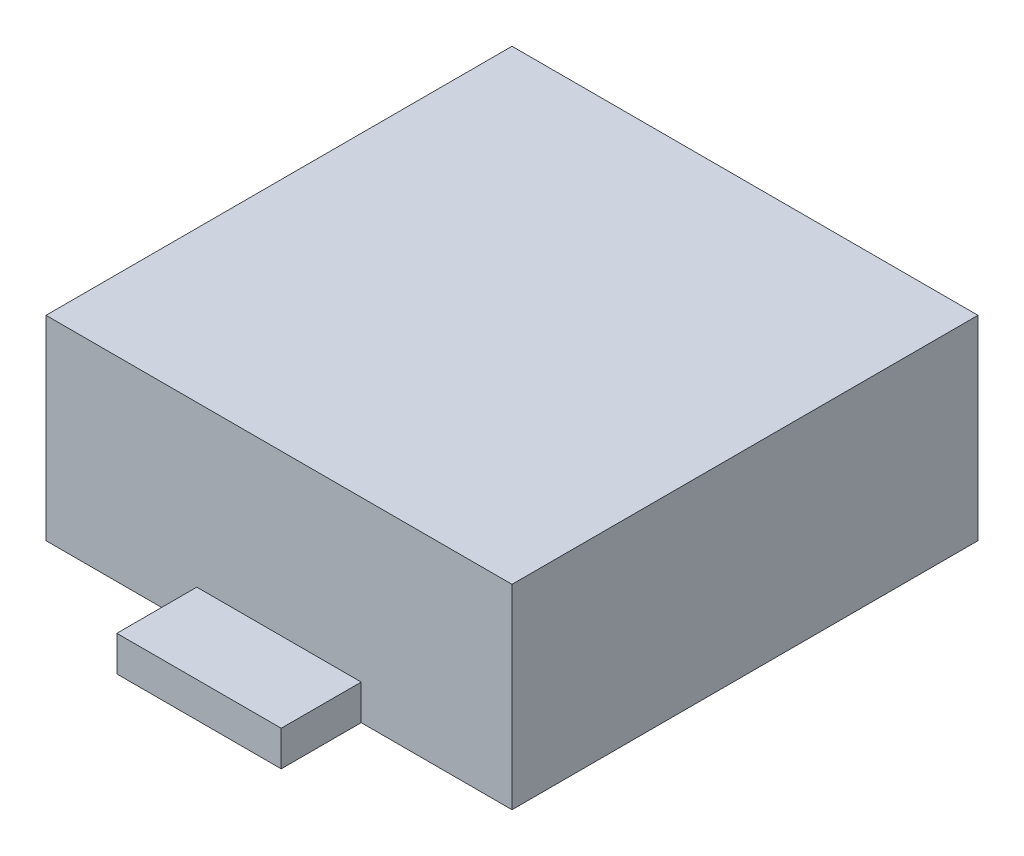
ISO-10303-21;
HEADER;
FILE_DESCRIPTION(('STEP AP214'),'2;1');
FILE_NAME('part.step','',(''),(''),'','','');
FILE_SCHEMA(('AUTOMOTIVE_DESIGN { 1 0 10303 214 1 1 1 1 }'));
ENDSEC;
DATA;
#1=APPLICATION_CONTEXT('core data for automotive mechanical design processes');
#2=APPLICATION_PROTOCOL_DEFINITION('international standard','automotive_design',2000,#1);
#3=PRODUCT_CONTEXT('',#1,'mechanical');
#4=PRODUCT('Part','Part','',(#3));
#5=PRODUCT_RELATED_PRODUCT_CATEGORY('part','',(#4));
#6=PRODUCT_DEFINITION_FORMATION('','',#4);
#7=PRODUCT_DEFINITION_CONTEXT('part definition',#1,'design');
#8=PRODUCT_DEFINITION('design','',#6,#7);
#9=PRODUCT_DEFINITION_SHAPE('','',#8);
#10=(LENGTH_UNIT() NAMED_UNIT(*) SI_UNIT(.MILLI.,.METRE.));
#11=(NAMED_UNIT(*) PLANE_ANGLE_UNIT() SI_UNIT($,.RADIAN.));
#12=(NAMED_UNIT(*) SI_UNIT($,.STERADIAN.) SOLID_ANGLE_UNIT());
#13=UNCERTAINTY_MEASURE_WITH_UNIT(LENGTH_MEASURE(1.E-05),#10,'distance_accuracy_value','');
#14=(GEOMETRIC_REPRESENTATION_CONTEXT(3) GLOBAL_UNCERTAINTY_ASSIGNED_CONTEXT((#13)) GLOBAL_UNIT_ASSIGNED_CONTEXT((#10,
#11,#12)) REPRESENTATION_CONTEXT('',''));
#15=CARTESIAN_POINT('',(0.,0.,0.));
#16=DIRECTION('',(0.,0.,1.));
#17=DIRECTION('',(1.,0.,0.));
#18=AXIS2_PLACEMENT_3D('',#15,#16,#17);
#19=CARTESIAN_POINT('',(0.,31.,0.));
#20=DIRECTION('',(0.,0.,-1.));
#21=DIRECTION('',(-1.,0.,0.));
#22=AXIS2_PLACEMENT_3D('',#19,#20,#21);
#23=PLANE('',#22);
#24=DIRECTION('',(0.,-1.,0.));
#25=VECTOR('',#24,1.);
#26=CARTESIAN_POINT('',(23.9467048567121,5.58863707499313,0.));
#27=LINE('',#26,#25);
#28=CARTESIAN_POINT('',(23.9467048567121,5.58863707499313,0.));
#29=VERTEX_POINT('',#28);
#30=CARTESIAN_POINT('',(23.9467048567121,0.,0.));
#31=VERTEX_POINT('',#30);
#32=EDGE_CURVE('E51',#29,#31,#27,.T.);
#33=ORIENTED_EDGE('',*,*,#32,.F.);
#34=DIRECTION('',(-1.,0.,0.));
#35=VECTOR('',#34,1.);
#36=CARTESIAN_POINT('',(23.9467048567121,5.58863707499313,0.));
#37=LINE('',#36,#35);
#38=CARTESIAN_POINT('',(50.0532951432879,5.58863707499314,0.));
#39=VERTEX_POINT('',#38);
#40=EDGE_CURVE('E120',#39,#29,#37,.T.);
#41=ORIENTED_EDGE('',*,*,#40,.F.);
#42=DIRECTION('',(0.,1.,0.));
#43=VECTOR('',#42,1.);
#44=CARTESIAN_POINT('',(50.0532951432879,5.58863707499314,0.));
#45=LINE('',#44,#43);
#46=CARTESIAN_POINT('',(50.0532951432879,0.,0.));
#47=VERTEX_POINT('',#46);
#48=EDGE_CURVE('E57',#47,#39,#45,.T.);
#49=ORIENTED_EDGE('',*,*,#48,.F.);
#50=DIRECTION('',(1.,0.,0.));
#51=VECTOR('',#50,1.);
#52=CARTESIAN_POINT('',(0.,0.,0.));
#53=LINE('',#52,#51);
#54=CARTESIAN_POINT('',(74.,0.,0.));
#55=VERTEX_POINT('',#54);
#56=EDGE_CURVE('E126',#47,#55,#53,.T.);
#57=ORIENTED_EDGE('',*,*,#56,.T.);
#58=DIRECTION('',(0.,-1.,0.));
#59=VECTOR('',#58,1.);
#60=CARTESIAN_POINT('',(74.,31.,0.));
#61=LINE('',#60,#59);
#62=CARTESIAN_POINT('',(74.,31.,0.));
#63=VERTEX_POINT('',#62);
#64=EDGE_CURVE('E44',#63,#55,#61,.T.);
#65=ORIENTED_EDGE('',*,*,#64,.F.);
#66=DIRECTION('',(1.,0.,0.));
#67=VECTOR('',#66,1.);
#68=CARTESIAN_POINT('',(0.,31.,0.));
#69=LINE('',#68,#67);
#70=CARTESIAN_POINT('',(0.,31.,0.));
#71=VERTEX_POINT('',#70);
#72=EDGE_CURVE('E135',#71,#63,#69,.T.);
#73=ORIENTED_EDGE('',*,*,#72,.F.);
#74=DIRECTION('',(0.,-1.,0.));
#75=VECTOR('',#74,1.);
#76=CARTESIAN_POINT('',(0.,31.,0.));
#77=LINE('',#76,#75);
#78=CARTESIAN_POINT('',(0.,0.,0.));
#79=VERTEX_POINT('',#78);
#80=EDGE_CURVE('E11',#71,#79,#77,.T.);
#81=ORIENTED_EDGE('',*,*,#80,.T.);
#82=EDGE_CURVE('E143',#79,#31,#53,.T.);
#83=ORIENTED_EDGE('',*,*,#82,.T.);
#84=EDGE_LOOP('',(#33,#41,#49,#57,#65,#73,#81,#83));
#85=FACE_BOUND('',#84,.T.);
#86=ADVANCED_FACE('F36',(#85),#23,.F.);
#87=CARTESIAN_POINT('',(0.,31.,0.));
#88=DIRECTION('',(1.,0.,0.));
#89=DIRECTION('',(0.,0.,-1.));
#90=AXIS2_PLACEMENT_3D('',#87,#88,#89);
#91=PLANE('',#90);
#92=DIRECTION('',(0.,0.,1.));
#93=VECTOR('',#92,1.);
#94=CARTESIAN_POINT('',(0.,0.,0.));
#95=LINE('',#94,#93);
#96=CARTESIAN_POINT('',(0.,0.,-74.));
#97=VERTEX_POINT('',#96);
#98=EDGE_CURVE('E123',#97,#79,#95,.T.);
#99=ORIENTED_EDGE('',*,*,#98,.T.);
#100=ORIENTED_EDGE('',*,*,#80,.F.);
#101=DIRECTION('',(0.,0.,1.));
#102=VECTOR('',#101,1.);
#103=CARTESIAN_POINT('',(0.,31.,0.));
#104=LINE('',#103,#102);
#105=CARTESIAN_POINT('',(0.,31.,-74.));
#106=VERTEX_POINT('',#105);
#107=EDGE_CURVE('E132',#106,#71,#104,.T.);
#108=ORIENTED_EDGE('',*,*,#107,.F.);
#109=DIRECTION('',(0.,-1.,0.));
#110=VECTOR('',#109,1.);
#111=CARTESIAN_POINT('',(0.,31.,-74.));
#112=LINE('',#111,#110);
#113=EDGE_CURVE('E141',#106,#97,#112,.T.);
#114=ORIENTED_EDGE('',*,*,#113,.T.);
#115=EDGE_LOOP('',(#99,#100,#108,#114));
#116=FACE_BOUND('',#115,.T.);
#117=ADVANCED_FACE('F38',(#116),#91,.F.);
#118=CARTESIAN_POINT('',(74.,31.,0.));
#119=DIRECTION('',(-1.,0.,0.));
#120=DIRECTION('',(0.,0.,1.));
#121=AXIS2_PLACEMENT_3D('',#118,#119,#120);
#122=PLANE('',#121);
#123=DIRECTION('',(0.,0.,-1.));
#124=VECTOR('',#123,1.);
#125=CARTESIAN_POINT('',(74.,0.,0.));
#126=LINE('',#125,#124);
#127=CARTESIAN_POINT('',(74.,0.,-74.));
#128=VERTEX_POINT('',#127);
#129=EDGE_CURVE('E145',#55,#128,#126,.T.);
#130=ORIENTED_EDGE('',*,*,#129,.T.);
#131=DIRECTION('',(0.,-1.,0.));
#132=VECTOR('',#131,1.);
#133=CARTESIAN_POINT('',(74.,31.,-74.));
#134=LINE('',#133,#132);
#135=CARTESIAN_POINT('',(74.,31.,-74.));
#136=VERTEX_POINT('',#135);
#137=EDGE_CURVE('E150',#136,#128,#134,.T.);
#138=ORIENTED_EDGE('',*,*,#137,.F.);
#139=DIRECTION('',(0.,0.,-1.));
#140=VECTOR('',#139,1.);
#141=CARTESIAN_POINT('',(74.,31.,0.));
#142=LINE('',#141,#140);
#143=EDGE_CURVE('E138',#63,#136,#142,.T.);
#144=ORIENTED_EDGE('',*,*,#143,.F.);
#145=ORIENTED_EDGE('',*,*,#64,.T.);
#146=EDGE_LOOP('',(#130,#138,#144,#145));
#147=FACE_BOUND('',#146,.T.);
#148=ADVANCED_FACE('F157',(#147),#122,.F.);
#149=CARTESIAN_POINT('',(0.,31.,-74.));
#150=DIRECTION('',(0.,0.,1.));
#151=DIRECTION('',(1.,0.,0.));
#152=AXIS2_PLACEMENT_3D('',#149,#150,#151);
#153=PLANE('',#152);
#154=DIRECTION('',(-1.,0.,0.));
#155=VECTOR('',#154,1.);
#156=CARTESIAN_POINT('',(0.,0.,-74.));
#157=LINE('',#156,#155);
#158=EDGE_CURVE('E136',#128,#97,#157,.T.);
#159=ORIENTED_EDGE('',*,*,#158,.T.);
#160=ORIENTED_EDGE('',*,*,#113,.F.);
#161=DIRECTION('',(-1.,0.,0.));
#162=VECTOR('',#161,1.);
#163=CARTESIAN_POINT('',(0.,31.,-74.));
#164=LINE('',#163,#162);
#165=EDGE_CURVE('E140',#136,#106,#164,.T.);
#166=ORIENTED_EDGE('',*,*,#165,.F.);
#167=ORIENTED_EDGE('',*,*,#137,.T.);
#168=EDGE_LOOP('',(#159,#160,#166,#167));
#169=FACE_BOUND('',#168,.T.);
#170=ADVANCED_FACE('F162',(#169),#153,.F.);
#171=CARTESIAN_POINT('',(0.,31.,0.));
#172=DIRECTION('',(0.,-1.,0.));
#173=DIRECTION('',(0.,0.,-1.));
#174=AXIS2_PLACEMENT_3D('',#171,#172,#173);
#175=PLANE('',#174);
#176=ORIENTED_EDGE('',*,*,#107,.T.);
#177=ORIENTED_EDGE('',*,*,#72,.T.);
#178=ORIENTED_EDGE('',*,*,#143,.T.);
#179=ORIENTED_EDGE('',*,*,#165,.T.);
#180=EDGE_LOOP('',(#176,#177,#178,#179));
#181=FACE_BOUND('',#180,.T.);
#182=ADVANCED_FACE('F168',(#181),#175,.F.);
#183=CARTESIAN_POINT('',(0.,0.,0.));
#184=DIRECTION('',(0.,-1.,0.));
#185=DIRECTION('',(0.,0.,-1.));
#186=AXIS2_PLACEMENT_3D('',#183,#184,#185);
#187=PLANE('',#186);
#188=ORIENTED_EDGE('',*,*,#98,.F.);
#189=ORIENTED_EDGE('',*,*,#158,.F.);
#190=ORIENTED_EDGE('',*,*,#129,.F.);
#191=ORIENTED_EDGE('',*,*,#56,.F.);
#192=DIRECTION('',(0.,0.,-1.));
#193=VECTOR('',#192,1.);
#194=CARTESIAN_POINT('',(50.0532951432879,0.,12.7));
#195=LINE('',#194,#193);
#196=CARTESIAN_POINT('',(50.0532951432879,0.,12.7));
#197=VERTEX_POINT('',#196);
#198=EDGE_CURVE('E107',#197,#47,#195,.T.);
#199=ORIENTED_EDGE('',*,*,#198,.F.);
#200=DIRECTION('',(1.,0.,0.));
#201=VECTOR('',#200,1.);
#202=CARTESIAN_POINT('',(23.9467048567121,0.,12.7));
#203=LINE('',#202,#201);
#204=CARTESIAN_POINT('',(23.9467048567121,0.,12.7));
#205=VERTEX_POINT('',#204);
#206=EDGE_CURVE('E100',#205,#197,#203,.T.);
#207=ORIENTED_EDGE('',*,*,#206,.F.);
#208=DIRECTION('',(0.,0.,-1.));
#209=VECTOR('',#208,1.);
#210=CARTESIAN_POINT('',(23.9467048567121,0.,12.7));
#211=LINE('',#210,#209);
#212=EDGE_CURVE('E105',#205,#31,#211,.T.);
#213=ORIENTED_EDGE('',*,*,#212,.T.);
#214=ORIENTED_EDGE('',*,*,#82,.F.);
#215=EDGE_LOOP('',(#188,#189,#190,#191,#199,#207,#213,#214));
#216=FACE_BOUND('',#215,.T.);
#217=ADVANCED_FACE('F103',(#216),#187,.T.);
#218=CARTESIAN_POINT('',(23.9467048567121,5.58863707499313,12.7));
#219=DIRECTION('',(1.,0.,0.));
#220=DIRECTION('',(0.,0.,-1.));
#221=AXIS2_PLACEMENT_3D('',#218,#219,#220);
#222=PLANE('',#221);
#223=ORIENTED_EDGE('',*,*,#32,.T.);
#224=ORIENTED_EDGE('',*,*,#212,.F.);
#225=DIRECTION('',(0.,-1.,0.));
#226=VECTOR('',#225,1.);
#227=CARTESIAN_POINT('',(23.9467048567121,5.58863707499313,12.7));
#228=LINE('',#227,#226);
#229=CARTESIAN_POINT('',(23.9467048567121,5.58863707499313,12.7));
#230=VERTEX_POINT('',#229);
#231=EDGE_CURVE('E111',#230,#205,#228,.T.);
#232=ORIENTED_EDGE('',*,*,#231,.F.);
#233=DIRECTION('',(0.,0.,-1.));
#234=VECTOR('',#233,1.);
#235=CARTESIAN_POINT('',(23.9467048567121,5.58863707499313,12.7));
#236=LINE('',#235,#234);
#237=EDGE_CURVE('E255',#230,#29,#236,.T.);
#238=ORIENTED_EDGE('',*,*,#237,.T.);
#239=EDGE_LOOP('',(#223,#224,#232,#238));
#240=FACE_BOUND('',#239,.T.);
#241=ADVANCED_FACE('F122',(#240),#222,.F.);
#242=CARTESIAN_POINT('',(50.0532951432879,5.58863707499314,12.7));
#243=DIRECTION('',(-1.,0.,0.));
#244=DIRECTION('',(0.,0.,1.));
#245=AXIS2_PLACEMENT_3D('',#242,#243,#244);
#246=PLANE('',#245);
#247=ORIENTED_EDGE('',*,*,#48,.T.);
#248=DIRECTION('',(0.,0.,-1.));
#249=VECTOR('',#248,1.);
#250=CARTESIAN_POINT('',(50.0532951432879,5.58863707499314,12.7));
#251=LINE('',#250,#249);
#252=CARTESIAN_POINT('',(50.0532951432879,5.58863707499314,12.7));
#253=VERTEX_POINT('',#252);
#254=EDGE_CURVE('E128',#253,#39,#251,.T.);
#255=ORIENTED_EDGE('',*,*,#254,.F.);
#256=DIRECTION('',(0.,1.,0.));
#257=VECTOR('',#256,1.);
#258=CARTESIAN_POINT('',(50.0532951432879,5.58863707499314,12.7));
#259=LINE('',#258,#257);
#260=EDGE_CURVE('E110',#197,#253,#259,.T.);
#261=ORIENTED_EDGE('',*,*,#260,.F.);
#262=ORIENTED_EDGE('',*,*,#198,.T.);
#263=EDGE_LOOP('',(#247,#255,#261,#262));
#264=FACE_BOUND('',#263,.T.);
#265=ADVANCED_FACE('F184',(#264),#246,.F.);
#266=CARTESIAN_POINT('',(23.9467048567121,5.58863707499313,12.7));
#267=DIRECTION('',(0.,-1.,0.));
#268=DIRECTION('',(1.,0.,0.));
#269=AXIS2_PLACEMENT_3D('',#266,#267,#268);
#270=PLANE('',#269);
#271=ORIENTED_EDGE('',*,*,#40,.T.);
#272=ORIENTED_EDGE('',*,*,#237,.F.);
#273=DIRECTION('',(-1.,0.,0.));
#274=VECTOR('',#273,1.);
#275=CARTESIAN_POINT('',(23.9467048567121,5.58863707499313,12.7));
#276=LINE('',#275,#274);
#277=EDGE_CURVE('E116',#253,#230,#276,.T.);
#278=ORIENTED_EDGE('',*,*,#277,.F.);
#279=ORIENTED_EDGE('',*,*,#254,.T.);
#280=EDGE_LOOP('',(#271,#272,#278,#279));
#281=FACE_BOUND('',#280,.T.);
#282=ADVANCED_FACE('F187',(#281),#270,.F.);
#283=CARTESIAN_POINT('',(0.,0.,12.7));
#284=DIRECTION('',(0.,0.,1.));
#285=DIRECTION('',(1.,0.,0.));
#286=AXIS2_PLACEMENT_3D('',#283,#284,#285);
#287=PLANE('',#286);
#288=ORIENTED_EDGE('',*,*,#231,.T.);
#289=ORIENTED_EDGE('',*,*,#206,.T.);
#290=ORIENTED_EDGE('',*,*,#260,.T.);
#291=ORIENTED_EDGE('',*,*,#277,.T.);
#292=EDGE_LOOP('',(#288,#289,#290,#291));
#293=FACE_BOUND('',#292,.T.);
#294=ADVANCED_FACE('F114',(#293),#287,.T.);
#295=CLOSED_SHELL('',(#86,#117,#148,#170,#182,#217,#241,#265,#282,#294));
#296=MANIFOLD_SOLID_BREP('B2',#295);
#297=ADVANCED_BREP_SHAPE_REPRESENTATION('',(#18,#296),#14);
#298=SHAPE_DEFINITION_REPRESENTATION(#9,#297);
ENDSEC;
END-ISO-10303-21;
